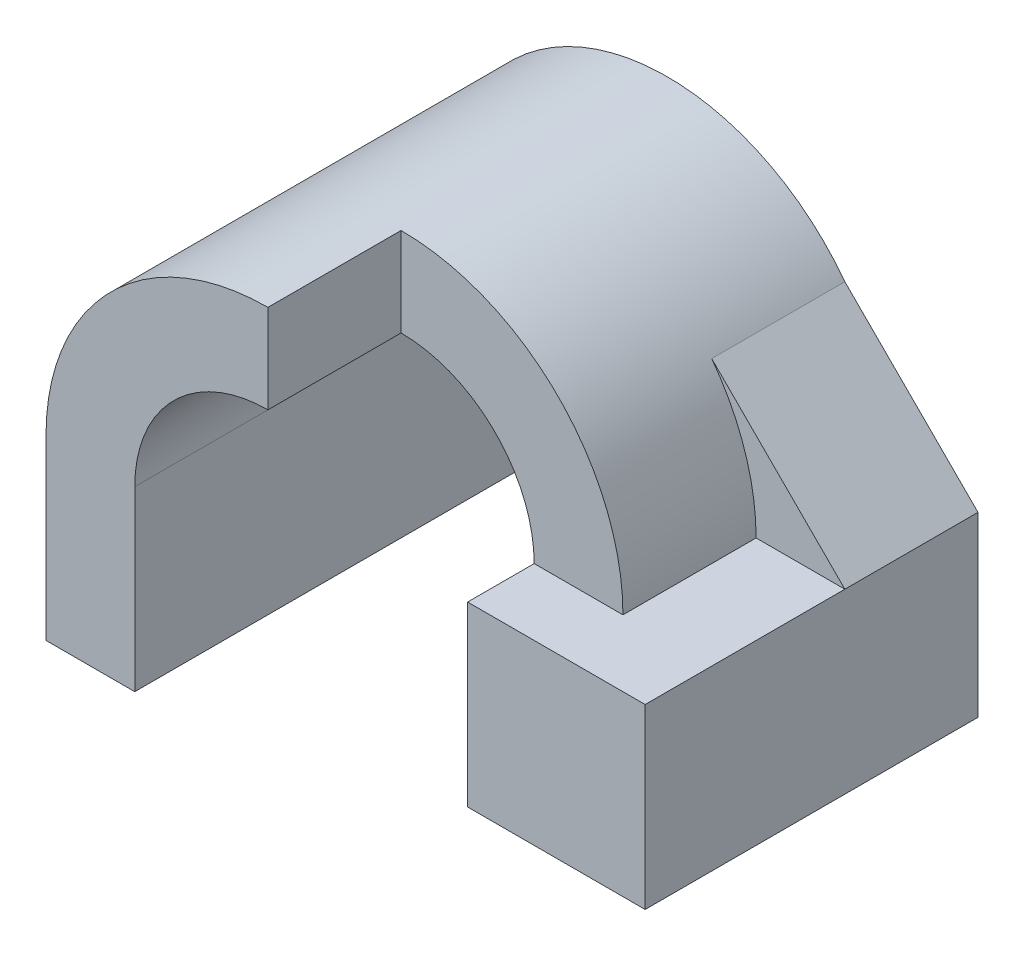
ISO-10303-21;
HEADER;
FILE_DESCRIPTION(('STEP AP214'),'2;1');
FILE_NAME('part.step','',(''),(''),'','','');
FILE_SCHEMA(('AUTOMOTIVE_DESIGN { 1 0 10303 214 1 1 1 1 }'));
ENDSEC;
DATA;
#1=APPLICATION_CONTEXT('core data for automotive mechanical design processes');
#2=APPLICATION_PROTOCOL_DEFINITION('international standard','automotive_design',2000,#1);
#3=PRODUCT_CONTEXT('',#1,'mechanical');
#4=PRODUCT('Part','Part','',(#3));
#5=PRODUCT_RELATED_PRODUCT_CATEGORY('part','',(#4));
#6=PRODUCT_DEFINITION_FORMATION('','',#4);
#7=PRODUCT_DEFINITION_CONTEXT('part definition',#1,'design');
#8=PRODUCT_DEFINITION('design','',#6,#7);
#9=PRODUCT_DEFINITION_SHAPE('','',#8);
#10=(LENGTH_UNIT() NAMED_UNIT(*) SI_UNIT(.MILLI.,.METRE.));
#11=(NAMED_UNIT(*) PLANE_ANGLE_UNIT() SI_UNIT($,.RADIAN.));
#12=(NAMED_UNIT(*) SI_UNIT($,.STERADIAN.) SOLID_ANGLE_UNIT());
#13=UNCERTAINTY_MEASURE_WITH_UNIT(LENGTH_MEASURE(1.E-05),#10,'distance_accuracy_value','');
#14=(GEOMETRIC_REPRESENTATION_CONTEXT(3) GLOBAL_UNCERTAINTY_ASSIGNED_CONTEXT((#13)) GLOBAL_UNIT_ASSIGNED_CONTEXT((#10,
#11,#12)) REPRESENTATION_CONTEXT('',''));
#15=CARTESIAN_POINT('',(0.,0.,0.));
#16=DIRECTION('',(0.,0.,1.));
#17=DIRECTION('',(1.,0.,0.));
#18=AXIS2_PLACEMENT_3D('',#15,#16,#17);
#19=CARTESIAN_POINT('',(0.,0.,6.));
#20=DIRECTION('',(0.,0.,1.));
#21=DIRECTION('',(1.,0.,0.));
#22=AXIS2_PLACEMENT_3D('',#19,#20,#21);
#23=PLANE('',#22);
#24=CARTESIAN_POINT('',(0.,0.,6.));
#25=DIRECTION('',(0.,0.,1.));
#26=DIRECTION('',(1.,0.,0.));
#27=AXIS2_PLACEMENT_3D('',#24,#25,#26);
#28=CIRCLE('',#27,3.);
#29=CARTESIAN_POINT('',(0.,3.,6.));
#30=VERTEX_POINT('',#29);
#31=CARTESIAN_POINT('',(3.,0.,6.));
#32=VERTEX_POINT('',#31);
#33=EDGE_CURVE('E189',#30,#32,#28,.F.);
#34=ORIENTED_EDGE('',*,*,#33,.T.);
#35=DIRECTION('',(1.,0.,0.));
#36=VECTOR('',#35,1.);
#37=CARTESIAN_POINT('',(0.,0.,6.));
#38=LINE('',#37,#36);
#39=CARTESIAN_POINT('',(5.,0.,6.));
#40=VERTEX_POINT('',#39);
#41=EDGE_CURVE('E11',#32,#40,#38,.T.);
#42=ORIENTED_EDGE('',*,*,#41,.T.);
#43=CARTESIAN_POINT('',(0.,0.,6.));
#44=DIRECTION('',(0.,0.,1.));
#45=DIRECTION('',(1.,0.,0.));
#46=AXIS2_PLACEMENT_3D('',#43,#44,#45);
#47=CIRCLE('',#46,5.);
#48=CARTESIAN_POINT('',(0.,5.,6.));
#49=VERTEX_POINT('',#48);
#50=EDGE_CURVE('E41',#40,#49,#47,.T.);
#51=ORIENTED_EDGE('',*,*,#50,.T.);
#52=DIRECTION('',(0.,-1.,0.));
#53=VECTOR('',#52,1.);
#54=CARTESIAN_POINT('',(0.,5.,6.));
#55=LINE('',#54,#53);
#56=EDGE_CURVE('E181',#49,#30,#55,.T.);
#57=ORIENTED_EDGE('',*,*,#56,.T.);
#58=EDGE_LOOP('',(#34,#42,#51,#57));
#59=FACE_BOUND('',#58,.T.);
#60=ADVANCED_FACE('F33',(#59),#23,.T.);
#61=CARTESIAN_POINT('',(3.,0.,9.));
#62=DIRECTION('',(1.,0.,0.));
#63=DIRECTION('',(0.,1.,0.));
#64=AXIS2_PLACEMENT_3D('',#61,#62,#63);
#65=PLANE('',#64);
#66=DIRECTION('',(0.,-1.,0.));
#67=VECTOR('',#66,1.);
#68=CARTESIAN_POINT('',(3.,0.,0.));
#69=LINE('',#68,#67);
#70=CARTESIAN_POINT('',(3.,0.,0.));
#71=VERTEX_POINT('',#70);
#72=CARTESIAN_POINT('',(3.,-4.,0.));
#73=VERTEX_POINT('',#72);
#74=EDGE_CURVE('E203',#71,#73,#69,.T.);
#75=ORIENTED_EDGE('',*,*,#74,.T.);
#76=DIRECTION('',(0.,0.,-1.));
#77=VECTOR('',#76,1.);
#78=CARTESIAN_POINT('',(3.,-4.,9.));
#79=LINE('',#78,#77);
#80=CARTESIAN_POINT('',(3.,-4.,7.5));
#81=VERTEX_POINT('',#80);
#82=EDGE_CURVE('E155',#81,#73,#79,.T.);
#83=ORIENTED_EDGE('',*,*,#82,.F.);
#84=DIRECTION('',(0.,-1.,0.));
#85=VECTOR('',#84,1.);
#86=CARTESIAN_POINT('',(3.,0.,7.5));
#87=LINE('',#86,#85);
#88=CARTESIAN_POINT('',(3.,0.,7.5));
#89=VERTEX_POINT('',#88);
#90=EDGE_CURVE('E251',#89,#81,#87,.T.);
#91=ORIENTED_EDGE('',*,*,#90,.F.);
#92=DIRECTION('',(0.,0.,-1.));
#93=VECTOR('',#92,1.);
#94=CARTESIAN_POINT('',(3.,0.,7.5));
#95=LINE('',#94,#93);
#96=EDGE_CURVE('E176',#89,#32,#95,.T.);
#97=ORIENTED_EDGE('',*,*,#96,.T.);
#98=DIRECTION('',(0.,0.,-1.));
#99=VECTOR('',#98,1.);
#100=CARTESIAN_POINT('',(3.,0.,9.));
#101=LINE('',#100,#99);
#102=EDGE_CURVE('E224',#32,#71,#101,.T.);
#103=ORIENTED_EDGE('',*,*,#102,.T.);
#104=EDGE_LOOP('',(#75,#83,#91,#97,#103));
#105=FACE_BOUND('',#104,.T.);
#106=ADVANCED_FACE('F249',(#105),#65,.F.);
#107=CARTESIAN_POINT('',(3.,-4.,9.));
#108=DIRECTION('',(0.,1.,0.));
#109=DIRECTION('',(-1.,0.,0.));
#110=AXIS2_PLACEMENT_3D('',#107,#108,#109);
#111=PLANE('',#110);
#112=DIRECTION('',(1.,0.,0.));
#113=VECTOR('',#112,1.);
#114=CARTESIAN_POINT('',(3.,-4.,0.));
#115=LINE('',#114,#113);
#116=CARTESIAN_POINT('',(7.,-4.,0.));
#117=VERTEX_POINT('',#116);
#118=EDGE_CURVE('E206',#73,#117,#115,.T.);
#119=ORIENTED_EDGE('',*,*,#118,.T.);
#120=DIRECTION('',(0.,0.,-1.));
#121=VECTOR('',#120,1.);
#122=CARTESIAN_POINT('',(7.,-4.,7.5));
#123=LINE('',#122,#121);
#124=CARTESIAN_POINT('',(7.,-4.,7.5));
#125=VERTEX_POINT('',#124);
#126=EDGE_CURVE('E173',#125,#117,#123,.T.);
#127=ORIENTED_EDGE('',*,*,#126,.F.);
#128=DIRECTION('',(1.,0.,0.));
#129=VECTOR('',#128,1.);
#130=CARTESIAN_POINT('',(7.,-4.,7.5));
#131=LINE('',#130,#129);
#132=EDGE_CURVE('E171',#81,#125,#131,.T.);
#133=ORIENTED_EDGE('',*,*,#132,.F.);
#134=ORIENTED_EDGE('',*,*,#82,.T.);
#135=EDGE_LOOP('',(#119,#127,#133,#134));
#136=FACE_BOUND('',#135,.T.);
#137=ADVANCED_FACE('F274',(#136),#111,.F.);
#138=CARTESIAN_POINT('',(0.,0.,9.));
#139=DIRECTION('',(0.,0.,-1.));
#140=DIRECTION('',(-1.,0.,0.));
#141=AXIS2_PLACEMENT_3D('',#138,#139,#140);
#142=CYLINDRICAL_SURFACE('',#141,3.);
#143=ORIENTED_EDGE('',*,*,#33,.F.);
#144=DIRECTION('',(0.,0.,-1.));
#145=VECTOR('',#144,1.);
#146=CARTESIAN_POINT('',(0.,3.,9.));
#147=LINE('',#146,#145);
#148=CARTESIAN_POINT('',(0.,3.,9.));
#149=VERTEX_POINT('',#148);
#150=EDGE_CURVE('E186',#30,#149,#147,.F.);
#151=ORIENTED_EDGE('',*,*,#150,.T.);
#152=CARTESIAN_POINT('',(0.,0.,9.));
#153=DIRECTION('',(0.,0.,-1.));
#154=DIRECTION('',(1.,0.,0.));
#155=AXIS2_PLACEMENT_3D('',#152,#153,#154);
#156=CIRCLE('',#155,3.);
#157=CARTESIAN_POINT('',(-3.,0.,9.));
#158=VERTEX_POINT('',#157);
#159=EDGE_CURVE('E192',#158,#149,#156,.T.);
#160=ORIENTED_EDGE('',*,*,#159,.F.);
#161=DIRECTION('',(0.,0.,-1.));
#162=VECTOR('',#161,1.);
#163=CARTESIAN_POINT('',(-3.,0.,9.));
#164=LINE('',#163,#162);
#165=CARTESIAN_POINT('',(-3.,0.,0.));
#166=VERTEX_POINT('',#165);
#167=EDGE_CURVE('E200',#158,#166,#164,.T.);
#168=ORIENTED_EDGE('',*,*,#167,.T.);
#169=CARTESIAN_POINT('',(0.,0.,0.));
#170=DIRECTION('',(0.,0.,-1.));
#171=DIRECTION('',(1.,0.,0.));
#172=AXIS2_PLACEMENT_3D('',#169,#170,#171);
#173=CIRCLE('',#172,3.);
#174=EDGE_CURVE('E191',#166,#71,#173,.T.);
#175=ORIENTED_EDGE('',*,*,#174,.T.);
#176=ORIENTED_EDGE('',*,*,#102,.F.);
#177=EDGE_LOOP('',(#143,#151,#160,#168,#175,#176));
#178=FACE_BOUND('',#177,.T.);
#179=ADVANCED_FACE('F35',(#178),#142,.F.);
#180=CARTESIAN_POINT('',(0.,0.,9.));
#181=DIRECTION('',(0.,0.,-1.));
#182=DIRECTION('',(-1.,0.,0.));
#183=AXIS2_PLACEMENT_3D('',#180,#181,#182);
#184=CYLINDRICAL_SURFACE('',#183,5.);
#185=CARTESIAN_POINT('',(0.,0.,3.));
#186=DIRECTION('',(0.,0.,1.));
#187=DIRECTION('',(1.,0.,0.));
#188=AXIS2_PLACEMENT_3D('',#185,#186,#187);
#189=CIRCLE('',#188,5.0000000000001);
#190=CARTESIAN_POINT('',(5.,0.,3.));
#191=VERTEX_POINT('',#190);
#192=CARTESIAN_POINT('',(4.,3.,3.));
#193=VERTEX_POINT('',#192);
#194=EDGE_CURVE('E138',#191,#193,#189,.T.);
#195=ORIENTED_EDGE('',*,*,#194,.T.);
#196=DIRECTION('',(0.,0.,-1.));
#197=VECTOR('',#196,1.);
#198=CARTESIAN_POINT('',(4.,3.,3.));
#199=LINE('',#198,#197);
#200=CARTESIAN_POINT('',(4.,3.,0.));
#201=VERTEX_POINT('',#200);
#202=EDGE_CURVE('E167',#193,#201,#199,.T.);
#203=ORIENTED_EDGE('',*,*,#202,.T.);
#204=CARTESIAN_POINT('',(0.,0.,0.));
#205=DIRECTION('',(0.,0.,1.));
#206=DIRECTION('',(1.,0.,0.));
#207=AXIS2_PLACEMENT_3D('',#204,#205,#206);
#208=CIRCLE('',#207,5.);
#209=CARTESIAN_POINT('',(-5.,0.,0.));
#210=VERTEX_POINT('',#209);
#211=EDGE_CURVE('E208',#201,#210,#208,.T.);
#212=ORIENTED_EDGE('',*,*,#211,.T.);
#213=DIRECTION('',(0.,0.,-1.));
#214=VECTOR('',#213,1.);
#215=CARTESIAN_POINT('',(-5.,0.,9.));
#216=LINE('',#215,#214);
#217=CARTESIAN_POINT('',(-5.,0.,9.));
#218=VERTEX_POINT('',#217);
#219=EDGE_CURVE('E156',#218,#210,#216,.T.);
#220=ORIENTED_EDGE('',*,*,#219,.F.);
#221=CARTESIAN_POINT('',(0.,0.,9.));
#222=DIRECTION('',(0.,0.,1.));
#223=DIRECTION('',(1.,0.,0.));
#224=AXIS2_PLACEMENT_3D('',#221,#222,#223);
#225=CIRCLE('',#224,5.);
#226=CARTESIAN_POINT('',(0.,5.,9.));
#227=VERTEX_POINT('',#226);
#228=EDGE_CURVE('E90',#227,#218,#225,.T.);
#229=ORIENTED_EDGE('',*,*,#228,.F.);
#230=DIRECTION('',(0.,0.,1.));
#231=VECTOR('',#230,1.);
#232=CARTESIAN_POINT('',(0.,5.,6.));
#233=LINE('',#232,#231);
#234=EDGE_CURVE('E48',#49,#227,#233,.T.);
#235=ORIENTED_EDGE('',*,*,#234,.F.);
#236=ORIENTED_EDGE('',*,*,#50,.F.);
#237=DIRECTION('',(0.,0.,-1.));
#238=VECTOR('',#237,1.);
#239=CARTESIAN_POINT('',(5.,0.,9.));
#240=LINE('',#239,#238);
#241=EDGE_CURVE('E151',#40,#191,#240,.T.);
#242=ORIENTED_EDGE('',*,*,#241,.T.);
#243=EDGE_LOOP('',(#195,#203,#212,#220,#229,#235,#236,#242));
#244=FACE_BOUND('',#243,.T.);
#245=ADVANCED_FACE('F152',(#244),#184,.T.);
#246=CARTESIAN_POINT('',(-5.,0.,9.));
#247=DIRECTION('',(1.,0.,0.));
#248=DIRECTION('',(0.,1.,0.));
#249=AXIS2_PLACEMENT_3D('',#246,#247,#248);
#250=PLANE('',#249);
#251=DIRECTION('',(0.,-1.,0.));
#252=VECTOR('',#251,1.);
#253=CARTESIAN_POINT('',(-5.,0.,0.));
#254=LINE('',#253,#252);
#255=CARTESIAN_POINT('',(-5.,-4.,0.));
#256=VERTEX_POINT('',#255);
#257=EDGE_CURVE('E210',#210,#256,#254,.T.);
#258=ORIENTED_EDGE('',*,*,#257,.T.);
#259=DIRECTION('',(0.,0.,-1.));
#260=VECTOR('',#259,1.);
#261=CARTESIAN_POINT('',(-5.,-4.,9.));
#262=LINE('',#261,#260);
#263=CARTESIAN_POINT('',(-5.,-4.,9.));
#264=VERTEX_POINT('',#263);
#265=EDGE_CURVE('E218',#264,#256,#262,.T.);
#266=ORIENTED_EDGE('',*,*,#265,.F.);
#267=DIRECTION('',(0.,-1.,0.));
#268=VECTOR('',#267,1.);
#269=CARTESIAN_POINT('',(-5.,0.,9.));
#270=LINE('',#269,#268);
#271=EDGE_CURVE('E195',#218,#264,#270,.T.);
#272=ORIENTED_EDGE('',*,*,#271,.F.);
#273=ORIENTED_EDGE('',*,*,#219,.T.);
#274=EDGE_LOOP('',(#258,#266,#272,#273));
#275=FACE_BOUND('',#274,.T.);
#276=ADVANCED_FACE('F233',(#275),#250,.F.);
#277=CARTESIAN_POINT('',(-5.,-4.,9.));
#278=DIRECTION('',(0.,1.,0.));
#279=DIRECTION('',(-1.,0.,0.));
#280=AXIS2_PLACEMENT_3D('',#277,#278,#279);
#281=PLANE('',#280);
#282=DIRECTION('',(1.,0.,0.));
#283=VECTOR('',#282,1.);
#284=CARTESIAN_POINT('',(-5.,-4.,0.));
#285=LINE('',#284,#283);
#286=CARTESIAN_POINT('',(-3.,-4.,0.));
#287=VERTEX_POINT('',#286);
#288=EDGE_CURVE('E212',#256,#287,#285,.T.);
#289=ORIENTED_EDGE('',*,*,#288,.T.);
#290=DIRECTION('',(0.,0.,-1.));
#291=VECTOR('',#290,1.);
#292=CARTESIAN_POINT('',(-3.,-4.,9.));
#293=LINE('',#292,#291);
#294=CARTESIAN_POINT('',(-3.,-4.,9.));
#295=VERTEX_POINT('',#294);
#296=EDGE_CURVE('E216',#295,#287,#293,.T.);
#297=ORIENTED_EDGE('',*,*,#296,.F.);
#298=DIRECTION('',(1.,0.,0.));
#299=VECTOR('',#298,1.);
#300=CARTESIAN_POINT('',(-5.,-4.,9.));
#301=LINE('',#300,#299);
#302=EDGE_CURVE('E197',#264,#295,#301,.T.);
#303=ORIENTED_EDGE('',*,*,#302,.F.);
#304=ORIENTED_EDGE('',*,*,#265,.T.);
#305=EDGE_LOOP('',(#289,#297,#303,#304));
#306=FACE_BOUND('',#305,.T.);
#307=ADVANCED_FACE('F238',(#306),#281,.F.);
#308=CARTESIAN_POINT('',(-3.,0.,9.));
#309=DIRECTION('',(-1.,0.,0.));
#310=DIRECTION('',(0.,-1.,0.));
#311=AXIS2_PLACEMENT_3D('',#308,#309,#310);
#312=PLANE('',#311);
#313=DIRECTION('',(0.,1.,0.));
#314=VECTOR('',#313,1.);
#315=CARTESIAN_POINT('',(-3.,0.,0.));
#316=LINE('',#315,#314);
#317=EDGE_CURVE('E84',#287,#166,#316,.T.);
#318=ORIENTED_EDGE('',*,*,#317,.T.);
#319=ORIENTED_EDGE('',*,*,#167,.F.);
#320=DIRECTION('',(0.,1.,0.));
#321=VECTOR('',#320,1.);
#322=CARTESIAN_POINT('',(-3.,0.,9.));
#323=LINE('',#322,#321);
#324=EDGE_CURVE('E57',#295,#158,#323,.T.);
#325=ORIENTED_EDGE('',*,*,#324,.F.);
#326=ORIENTED_EDGE('',*,*,#296,.T.);
#327=EDGE_LOOP('',(#318,#319,#325,#326));
#328=FACE_BOUND('',#327,.T.);
#329=ADVANCED_FACE('F240',(#328),#312,.F.);
#330=CARTESIAN_POINT('',(0.,0.,9.));
#331=DIRECTION('',(0.,0.,1.));
#332=DIRECTION('',(1.,0.,0.));
#333=AXIS2_PLACEMENT_3D('',#330,#331,#332);
#334=PLANE('',#333);
#335=DIRECTION('',(0.,-1.,0.));
#336=VECTOR('',#335,1.);
#337=CARTESIAN_POINT('',(0.,5.,9.));
#338=LINE('',#337,#336);
#339=EDGE_CURVE('E180',#227,#149,#338,.T.);
#340=ORIENTED_EDGE('',*,*,#339,.F.);
#341=ORIENTED_EDGE('',*,*,#228,.T.);
#342=ORIENTED_EDGE('',*,*,#271,.T.);
#343=ORIENTED_EDGE('',*,*,#302,.T.);
#344=ORIENTED_EDGE('',*,*,#324,.T.);
#345=ORIENTED_EDGE('',*,*,#159,.T.);
#346=EDGE_LOOP('',(#340,#341,#342,#343,#344,#345));
#347=FACE_BOUND('',#346,.T.);
#348=ADVANCED_FACE('F235',(#347),#334,.T.);
#349=CARTESIAN_POINT('',(0.,0.,0.));
#350=DIRECTION('',(0.,0.,1.));
#351=DIRECTION('',(1.,0.,0.));
#352=AXIS2_PLACEMENT_3D('',#349,#350,#351);
#353=PLANE('',#352);
#354=ORIENTED_EDGE('',*,*,#174,.F.);
#355=ORIENTED_EDGE('',*,*,#317,.F.);
#356=ORIENTED_EDGE('',*,*,#288,.F.);
#357=ORIENTED_EDGE('',*,*,#257,.F.);
#358=ORIENTED_EDGE('',*,*,#211,.F.);
#359=DIRECTION('',(0.707106781186548,-0.707106781186547,0.));
#360=VECTOR('',#359,1.);
#361=CARTESIAN_POINT('',(7.,0.,0.));
#362=LINE('',#361,#360);
#363=CARTESIAN_POINT('',(7.,0.,0.));
#364=VERTEX_POINT('',#363);
#365=EDGE_CURVE('E259',#201,#364,#362,.T.);
#366=ORIENTED_EDGE('',*,*,#365,.T.);
#367=DIRECTION('',(0.,-1.,0.));
#368=VECTOR('',#367,1.);
#369=CARTESIAN_POINT('',(7.,-4.,0.));
#370=LINE('',#369,#368);
#371=EDGE_CURVE('E147',#364,#117,#370,.T.);
#372=ORIENTED_EDGE('',*,*,#371,.T.);
#373=ORIENTED_EDGE('',*,*,#118,.F.);
#374=ORIENTED_EDGE('',*,*,#74,.F.);
#375=EDGE_LOOP('',(#354,#355,#356,#357,#358,#366,#372,#373,#374));
#376=FACE_BOUND('',#375,.T.);
#377=ADVANCED_FACE('F272',(#376),#353,.F.);
#378=CARTESIAN_POINT('',(0.,5.,6.));
#379=DIRECTION('',(-1.,0.,0.));
#380=DIRECTION('',(0.,0.,1.));
#381=AXIS2_PLACEMENT_3D('',#378,#379,#380);
#382=PLANE('',#381);
#383=ORIENTED_EDGE('',*,*,#56,.F.);
#384=ORIENTED_EDGE('',*,*,#234,.T.);
#385=ORIENTED_EDGE('',*,*,#339,.T.);
#386=ORIENTED_EDGE('',*,*,#150,.F.);
#387=EDGE_LOOP('',(#383,#384,#385,#386));
#388=FACE_BOUND('',#387,.T.);
#389=ADVANCED_FACE('F227',(#388),#382,.F.);
#390=CARTESIAN_POINT('',(7.,0.,7.5));
#391=DIRECTION('',(0.,-1.,0.));
#392=DIRECTION('',(0.,0.,-1.));
#393=AXIS2_PLACEMENT_3D('',#390,#391,#392);
#394=PLANE('',#393);
#395=DIRECTION('',(-1.,0.,0.));
#396=VECTOR('',#395,1.);
#397=CARTESIAN_POINT('',(7.,0.,3.));
#398=LINE('',#397,#396);
#399=CARTESIAN_POINT('',(7.,0.,3.));
#400=VERTEX_POINT('',#399);
#401=EDGE_CURVE('E142',#400,#191,#398,.T.);
#402=ORIENTED_EDGE('',*,*,#401,.T.);
#403=ORIENTED_EDGE('',*,*,#241,.F.);
#404=ORIENTED_EDGE('',*,*,#41,.F.);
#405=ORIENTED_EDGE('',*,*,#96,.F.);
#406=DIRECTION('',(-1.,0.,0.));
#407=VECTOR('',#406,1.);
#408=CARTESIAN_POINT('',(7.,0.,7.5));
#409=LINE('',#408,#407);
#410=CARTESIAN_POINT('',(7.,0.,7.5));
#411=VERTEX_POINT('',#410);
#412=EDGE_CURVE('E165',#411,#89,#409,.T.);
#413=ORIENTED_EDGE('',*,*,#412,.F.);
#414=DIRECTION('',(0.,0.,-1.));
#415=VECTOR('',#414,1.);
#416=CARTESIAN_POINT('',(7.,0.,7.5));
#417=LINE('',#416,#415);
#418=EDGE_CURVE('E160',#411,#400,#417,.T.);
#419=ORIENTED_EDGE('',*,*,#418,.T.);
#420=EDGE_LOOP('',(#402,#403,#404,#405,#413,#419));
#421=FACE_BOUND('',#420,.T.);
#422=ADVANCED_FACE('F158',(#421),#394,.F.);
#423=CARTESIAN_POINT('',(7.,0.,7.5));
#424=DIRECTION('',(-1.,0.,0.));
#425=DIRECTION('',(0.,0.,1.));
#426=AXIS2_PLACEMENT_3D('',#423,#424,#425);
#427=PLANE('',#426);
#428=ORIENTED_EDGE('',*,*,#126,.T.);
#429=ORIENTED_EDGE('',*,*,#371,.F.);
#430=DIRECTION('',(0.,0.,-1.));
#431=VECTOR('',#430,1.);
#432=CARTESIAN_POINT('',(7.,0.,3.));
#433=LINE('',#432,#431);
#434=EDGE_CURVE('E162',#400,#364,#433,.T.);
#435=ORIENTED_EDGE('',*,*,#434,.F.);
#436=ORIENTED_EDGE('',*,*,#418,.F.);
#437=DIRECTION('',(0.,1.,0.));
#438=VECTOR('',#437,1.);
#439=CARTESIAN_POINT('',(7.,0.,7.5));
#440=LINE('',#439,#438);
#441=EDGE_CURVE('E161',#125,#411,#440,.T.);
#442=ORIENTED_EDGE('',*,*,#441,.F.);
#443=EDGE_LOOP('',(#428,#429,#435,#436,#442));
#444=FACE_BOUND('',#443,.T.);
#445=ADVANCED_FACE('F267',(#444),#427,.F.);
#446=CARTESIAN_POINT('',(0.,0.,7.5));
#447=DIRECTION('',(0.,0.,-1.));
#448=DIRECTION('',(-1.,0.,0.));
#449=AXIS2_PLACEMENT_3D('',#446,#447,#448);
#450=PLANE('',#449);
#451=ORIENTED_EDGE('',*,*,#441,.T.);
#452=ORIENTED_EDGE('',*,*,#412,.T.);
#453=ORIENTED_EDGE('',*,*,#90,.T.);
#454=ORIENTED_EDGE('',*,*,#132,.T.);
#455=EDGE_LOOP('',(#451,#452,#453,#454));
#456=FACE_BOUND('',#455,.T.);
#457=ADVANCED_FACE('F275',(#456),#450,.F.);
#458=CARTESIAN_POINT('',(0.,0.,3.));
#459=DIRECTION('',(0.,0.,1.));
#460=DIRECTION('',(1.,0.,0.));
#461=AXIS2_PLACEMENT_3D('',#458,#459,#460);
#462=PLANE('',#461);
#463=ORIENTED_EDGE('',*,*,#401,.F.);
#464=DIRECTION('',(0.707106781186548,-0.707106781186547,0.));
#465=VECTOR('',#464,1.);
#466=CARTESIAN_POINT('',(7.,0.,3.));
#467=LINE('',#466,#465);
#468=EDGE_CURVE('E144',#193,#400,#467,.T.);
#469=ORIENTED_EDGE('',*,*,#468,.F.);
#470=ORIENTED_EDGE('',*,*,#194,.F.);
#471=EDGE_LOOP('',(#463,#469,#470));
#472=FACE_BOUND('',#471,.T.);
#473=ADVANCED_FACE('F140',(#472),#462,.T.);
#474=CARTESIAN_POINT('',(7.,0.,3.));
#475=DIRECTION('',(0.707106781186547,0.707106781186548,0.));
#476=DIRECTION('',(-0.707106781186548,0.707106781186547,0.));
#477=AXIS2_PLACEMENT_3D('',#474,#475,#476);
#478=PLANE('',#477);
#479=ORIENTED_EDGE('',*,*,#365,.F.);
#480=ORIENTED_EDGE('',*,*,#202,.F.);
#481=ORIENTED_EDGE('',*,*,#468,.T.);
#482=ORIENTED_EDGE('',*,*,#434,.T.);
#483=EDGE_LOOP('',(#479,#480,#481,#482));
#484=FACE_BOUND('',#483,.T.);
#485=ADVANCED_FACE('F264',(#484),#478,.T.);
#486=CLOSED_SHELL('',(#60,#106,#137,#179,#245,#276,#307,#329,#348,#377,#389,#422,#445,#457,#473,#485));
#487=MANIFOLD_SOLID_BREP('B2',#486);
#488=ADVANCED_BREP_SHAPE_REPRESENTATION('',(#18,#487),#14);
#489=SHAPE_DEFINITION_REPRESENTATION(#9,#488);
ENDSEC;
END-ISO-10303-21;
